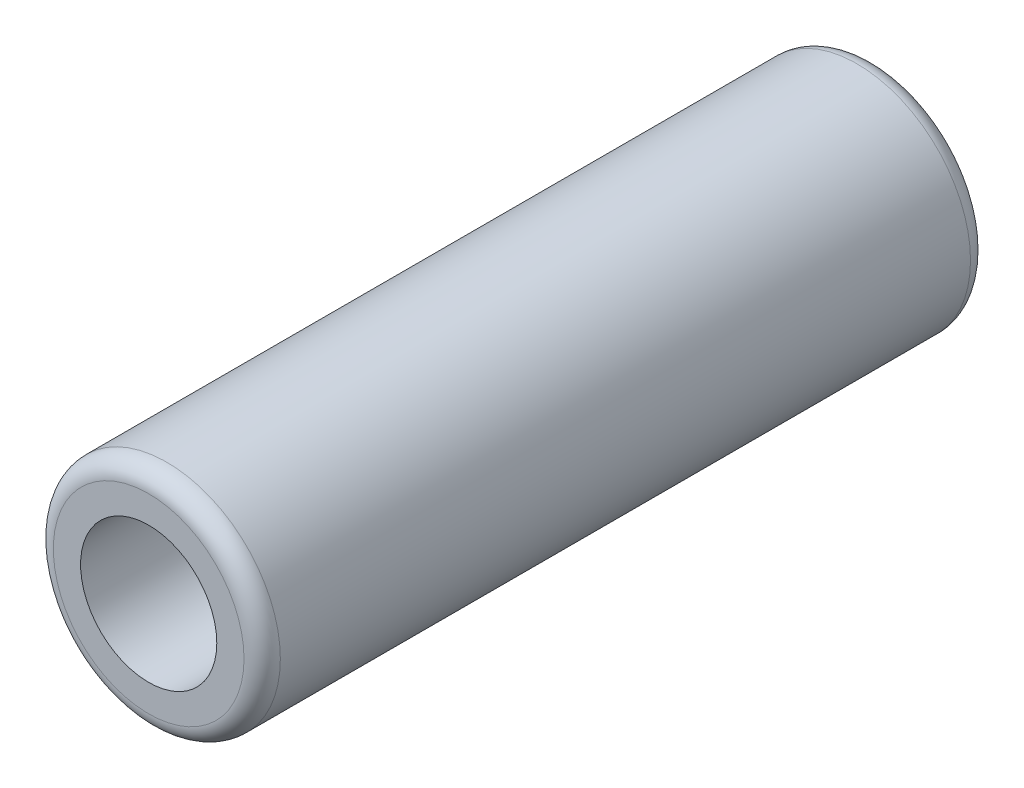
ISO-10303-21;
HEADER;
FILE_DESCRIPTION(('STEP AP214'),'2;1');
FILE_NAME('part.step','',(''),(''),'','','');
FILE_SCHEMA(('AUTOMOTIVE_DESIGN { 1 0 10303 214 1 1 1 1 }'));
ENDSEC;
DATA;
#1=APPLICATION_CONTEXT('core data for automotive mechanical design processes');
#2=APPLICATION_PROTOCOL_DEFINITION('international standard','automotive_design',2000,#1);
#3=PRODUCT_CONTEXT('',#1,'mechanical');
#4=PRODUCT('Part','Part','',(#3));
#5=PRODUCT_RELATED_PRODUCT_CATEGORY('part','',(#4));
#6=PRODUCT_DEFINITION_FORMATION('','',#4);
#7=PRODUCT_DEFINITION_CONTEXT('part definition',#1,'design');
#8=PRODUCT_DEFINITION('design','',#6,#7);
#9=PRODUCT_DEFINITION_SHAPE('','',#8);
#10=(LENGTH_UNIT() NAMED_UNIT(*) SI_UNIT(.MILLI.,.METRE.));
#11=(NAMED_UNIT(*) PLANE_ANGLE_UNIT() SI_UNIT($,.RADIAN.));
#12=(NAMED_UNIT(*) SI_UNIT($,.STERADIAN.) SOLID_ANGLE_UNIT());
#13=UNCERTAINTY_MEASURE_WITH_UNIT(LENGTH_MEASURE(1.E-05),#10,'distance_accuracy_value','');
#14=(GEOMETRIC_REPRESENTATION_CONTEXT(3) GLOBAL_UNCERTAINTY_ASSIGNED_CONTEXT((#13)) GLOBAL_UNIT_ASSIGNED_CONTEXT((#10,
#11,#12)) REPRESENTATION_CONTEXT('',''));
#15=CARTESIAN_POINT('',(0.,0.,0.));
#16=DIRECTION('',(0.,0.,1.));
#17=DIRECTION('',(1.,0.,0.));
#18=AXIS2_PLACEMENT_3D('',#15,#16,#17);
#19=CARTESIAN_POINT('',(0.,0.,200.));
#20=DIRECTION('',(0.,0.,1.));
#21=DIRECTION('',(1.,0.,0.));
#22=AXIS2_PLACEMENT_3D('',#19,#20,#21);
#23=PLANE('',#22);
#24=CARTESIAN_POINT('',(0.,0.,200.));
#25=DIRECTION('',(0.,0.,1.));
#26=DIRECTION('',(1.,0.,0.));
#27=AXIS2_PLACEMENT_3D('',#24,#25,#26);
#28=CIRCLE('',#27,52.5);
#29=CARTESIAN_POINT('',(52.5,0.,200.));
#30=VERTEX_POINT('',#29);
#31=EDGE_CURVE('E10',#30,#30,#28,.T.);
#32=ORIENTED_EDGE('',*,*,#31,.T.);
#33=EDGE_LOOP('',(#32));
#34=FACE_BOUND('',#33,.T.);
#35=CARTESIAN_POINT('',(0.,0.,200.));
#36=DIRECTION('',(0.,0.,1.));
#37=DIRECTION('',(1.,0.,0.));
#38=AXIS2_PLACEMENT_3D('',#35,#36,#37);
#39=CIRCLE('',#38,37.5);
#40=CARTESIAN_POINT('',(37.5,0.,200.));
#41=VERTEX_POINT('',#40);
#42=EDGE_CURVE('E54',#41,#41,#39,.T.);
#43=ORIENTED_EDGE('',*,*,#42,.F.);
#44=EDGE_LOOP('',(#43));
#45=FACE_BOUND('',#44,.T.);
#46=ADVANCED_FACE('F34',(#34,#45),#23,.T.);
#47=CARTESIAN_POINT('',(0.,0.,-200.));
#48=DIRECTION('',(0.,0.,1.));
#49=DIRECTION('',(1.,0.,0.));
#50=AXIS2_PLACEMENT_3D('',#47,#48,#49);
#51=PLANE('',#50);
#52=CARTESIAN_POINT('',(0.,0.,-200.));
#53=DIRECTION('',(0.,0.,1.));
#54=DIRECTION('',(1.,0.,0.));
#55=AXIS2_PLACEMENT_3D('',#52,#53,#54);
#56=CIRCLE('',#55,52.5);
#57=CARTESIAN_POINT('',(52.5,0.,-200.));
#58=VERTEX_POINT('',#57);
#59=EDGE_CURVE('E41',#58,#58,#56,.F.);
#60=ORIENTED_EDGE('',*,*,#59,.T.);
#61=EDGE_LOOP('',(#60));
#62=FACE_BOUND('',#61,.T.);
#63=CARTESIAN_POINT('',(0.,0.,-200.));
#64=DIRECTION('',(0.,0.,1.));
#65=DIRECTION('',(1.,0.,0.));
#66=AXIS2_PLACEMENT_3D('',#63,#64,#65);
#67=CIRCLE('',#66,37.5);
#68=CARTESIAN_POINT('',(37.5,0.,-200.));
#69=VERTEX_POINT('',#68);
#70=EDGE_CURVE('E55',#69,#69,#67,.T.);
#71=ORIENTED_EDGE('',*,*,#70,.T.);
#72=EDGE_LOOP('',(#71));
#73=FACE_BOUND('',#72,.T.);
#74=ADVANCED_FACE('F65',(#62,#73),#51,.F.);
#75=CARTESIAN_POINT('',(0.,0.,200.));
#76=DIRECTION('',(0.,0.,-1.));
#77=DIRECTION('',(-1.,0.,0.));
#78=AXIS2_PLACEMENT_3D('',#75,#76,#77);
#79=CYLINDRICAL_SURFACE('',#78,62.5);
#80=CARTESIAN_POINT('',(0.,0.,-190.));
#81=DIRECTION('',(0.,0.,1.));
#82=DIRECTION('',(1.,0.,0.));
#83=AXIS2_PLACEMENT_3D('',#80,#81,#82);
#84=CIRCLE('',#83,62.5);
#85=CARTESIAN_POINT('',(62.5,0.,-190.));
#86=VERTEX_POINT('',#85);
#87=EDGE_CURVE('E45',#86,#86,#84,.T.);
#88=ORIENTED_EDGE('',*,*,#87,.T.);
#89=EDGE_LOOP('',(#88));
#90=FACE_BOUND('',#89,.T.);
#91=CARTESIAN_POINT('',(0.,0.,190.));
#92=DIRECTION('',(0.,0.,1.));
#93=DIRECTION('',(1.,0.,0.));
#94=AXIS2_PLACEMENT_3D('',#91,#92,#93);
#95=CIRCLE('',#94,62.5);
#96=CARTESIAN_POINT('',(62.5,0.,190.));
#97=VERTEX_POINT('',#96);
#98=EDGE_CURVE('E49',#97,#97,#95,.F.);
#99=ORIENTED_EDGE('',*,*,#98,.T.);
#100=EDGE_LOOP('',(#99));
#101=FACE_BOUND('',#100,.T.);
#102=ADVANCED_FACE('F70',(#90,#101),#79,.T.);
#103=CARTESIAN_POINT('',(0.,0.,200.));
#104=DIRECTION('',(0.,0.,-1.));
#105=DIRECTION('',(-1.,0.,0.));
#106=AXIS2_PLACEMENT_3D('',#103,#104,#105);
#107=CYLINDRICAL_SURFACE('',#106,37.5);
#108=ORIENTED_EDGE('',*,*,#42,.T.);
#109=EDGE_LOOP('',(#108));
#110=FACE_BOUND('',#109,.T.);
#111=ORIENTED_EDGE('',*,*,#70,.F.);
#112=EDGE_LOOP('',(#111));
#113=FACE_BOUND('',#112,.T.);
#114=ADVANCED_FACE('F61',(#110,#113),#107,.F.);
#115=CARTESIAN_POINT('',(0.,0.,-190.));
#116=DIRECTION('',(0.,0.,1.));
#117=DIRECTION('',(1.,0.,0.));
#118=AXIS2_PLACEMENT_3D('',#115,#116,#117);
#119=TOROIDAL_SURFACE('',#118,52.5,10.);
#120=ORIENTED_EDGE('',*,*,#59,.F.);
#121=EDGE_LOOP('',(#120));
#122=FACE_BOUND('',#121,.T.);
#123=ORIENTED_EDGE('',*,*,#87,.F.);
#124=EDGE_LOOP('',(#123));
#125=FACE_BOUND('',#124,.T.);
#126=ADVANCED_FACE('F76',(#122,#125),#119,.T.);
#127=CARTESIAN_POINT('',(0.,0.,190.));
#128=DIRECTION('',(0.,0.,1.));
#129=DIRECTION('',(1.,0.,0.));
#130=AXIS2_PLACEMENT_3D('',#127,#128,#129);
#131=TOROIDAL_SURFACE('',#130,52.5,10.);
#132=ORIENTED_EDGE('',*,*,#98,.F.);
#133=EDGE_LOOP('',(#132));
#134=FACE_BOUND('',#133,.T.);
#135=ORIENTED_EDGE('',*,*,#31,.F.);
#136=EDGE_LOOP('',(#135));
#137=FACE_BOUND('',#136,.T.);
#138=ADVANCED_FACE('F36',(#134,#137),#131,.T.);
#139=CLOSED_SHELL('',(#46,#74,#102,#114,#126,#138));
#140=MANIFOLD_SOLID_BREP('B2',#139);
#141=ADVANCED_BREP_SHAPE_REPRESENTATION('',(#18,#140),#14);
#142=SHAPE_DEFINITION_REPRESENTATION(#9,#141);
ENDSEC;
END-ISO-10303-21;
